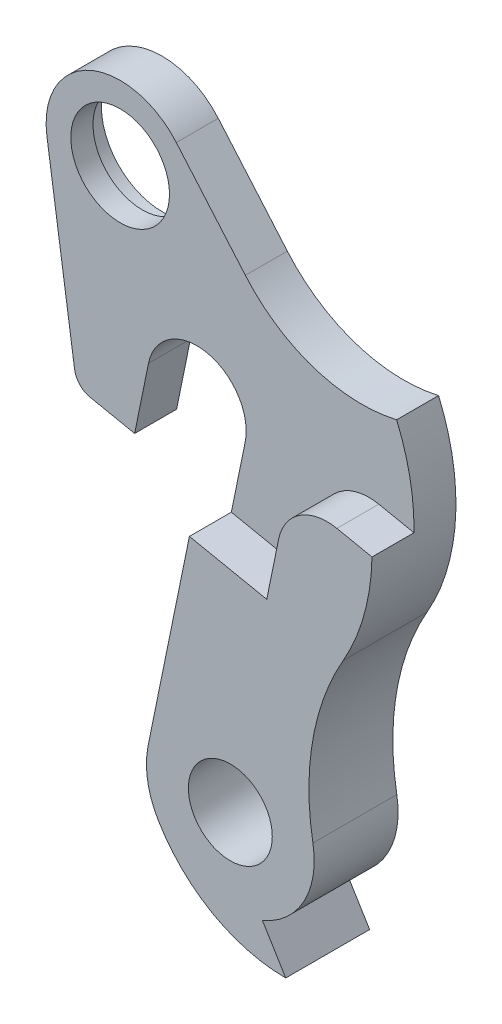
ISO-10303-21;
HEADER;
FILE_DESCRIPTION(('STEP AP214'),'2;1');
FILE_NAME('part.step','',(''),(''),'','','');
FILE_SCHEMA(('AUTOMOTIVE_DESIGN { 1 0 10303 214 1 1 1 1 }'));
ENDSEC;
DATA;
#1=APPLICATION_CONTEXT('core data for automotive mechanical design processes');
#2=APPLICATION_PROTOCOL_DEFINITION('international standard','automotive_design',2000,#1);
#3=PRODUCT_CONTEXT('',#1,'mechanical');
#4=PRODUCT('Part','Part','',(#3));
#5=PRODUCT_RELATED_PRODUCT_CATEGORY('part','',(#4));
#6=PRODUCT_DEFINITION_FORMATION('','',#4);
#7=PRODUCT_DEFINITION_CONTEXT('part definition',#1,'design');
#8=PRODUCT_DEFINITION('design','',#6,#7);
#9=PRODUCT_DEFINITION_SHAPE('','',#8);
#10=(LENGTH_UNIT() NAMED_UNIT(*) SI_UNIT(.MILLI.,.METRE.));
#11=(NAMED_UNIT(*) PLANE_ANGLE_UNIT() SI_UNIT($,.RADIAN.));
#12=(NAMED_UNIT(*) SI_UNIT($,.STERADIAN.) SOLID_ANGLE_UNIT());
#13=UNCERTAINTY_MEASURE_WITH_UNIT(LENGTH_MEASURE(1.E-05),#10,'distance_accuracy_value','');
#14=(GEOMETRIC_REPRESENTATION_CONTEXT(3) GLOBAL_UNCERTAINTY_ASSIGNED_CONTEXT((#13)) GLOBAL_UNIT_ASSIGNED_CONTEXT((#10,
#11,#12)) REPRESENTATION_CONTEXT('',''));
#15=CARTESIAN_POINT('',(0.,0.,0.));
#16=DIRECTION('',(0.,0.,1.));
#17=DIRECTION('',(1.,0.,0.));
#18=AXIS2_PLACEMENT_3D('',#15,#16,#17);
#19=CARTESIAN_POINT('',(-7.77100748891503,16.9000426806333,-4.25));
#20=DIRECTION('',(0.,0.,1.));
#21=DIRECTION('',(1.,0.,0.));
#22=AXIS2_PLACEMENT_3D('',#19,#20,#21);
#23=CYLINDRICAL_SURFACE('',#22,5.);
#24=CARTESIAN_POINT('',(-7.77100748891503,16.9000426806333,0.));
#25=DIRECTION('',(0.,0.,1.));
#26=DIRECTION('',(1.,0.,0.));
#27=AXIS2_PLACEMENT_3D('',#24,#25,#26);
#28=CIRCLE('',#27,5.);
#29=CARTESIAN_POINT('',(-2.77100748891502,16.9000426806333,0.));
#30=VERTEX_POINT('',#29);
#31=EDGE_CURVE('E175',#30,#30,#28,.T.);
#32=ORIENTED_EDGE('',*,*,#31,.T.);
#33=EDGE_LOOP('',(#32));
#34=FACE_BOUND('',#33,.T.);
#35=CARTESIAN_POINT('',(-7.77100748891503,16.9000426806333,-2.25));
#36=DIRECTION('',(0.,0.,-1.));
#37=DIRECTION('',(-1.,0.,0.));
#38=AXIS2_PLACEMENT_3D('',#35,#36,#37);
#39=CIRCLE('',#38,5.);
#40=CARTESIAN_POINT('',(-12.771007488915,16.9000426806333,-2.25));
#41=VERTEX_POINT('',#40);
#42=EDGE_CURVE('E30',#41,#41,#39,.F.);
#43=ORIENTED_EDGE('',*,*,#42,.F.);
#44=EDGE_LOOP('',(#43));
#45=FACE_BOUND('',#44,.T.);
#46=ADVANCED_FACE('F26',(#34,#45),#23,.F.);
#47=CARTESIAN_POINT('',(-6.30131824569519,-5.85605570042413,4.25));
#48=DIRECTION('',(-0.979715961235735,0.200391205645205,0.));
#49=DIRECTION('',(-0.200391205645205,-0.979715961235735,0.));
#50=AXIS2_PLACEMENT_3D('',#47,#48,#49);
#51=PLANE('',#50);
#52=DIRECTION('',(0.200391205645209,0.979715961235735,0.));
#53=VECTOR('',#52,1.);
#54=CARTESIAN_POINT('',(-6.30131824569519,-5.85605570042413,0.));
#55=LINE('',#54,#53);
#56=CARTESIAN_POINT('',(-6.30131824569519,-5.85605570042413,0.));
#57=VERTEX_POINT('',#56);
#58=CARTESIAN_POINT('',(-4.89857980617872,1.00195602822603,0.));
#59=VERTEX_POINT('',#58);
#60=EDGE_CURVE('E168',#57,#59,#55,.T.);
#61=ORIENTED_EDGE('',*,*,#60,.F.);
#62=DIRECTION('',(0.,0.,-1.));
#63=VECTOR('',#62,1.);
#64=CARTESIAN_POINT('',(-6.30131824569519,-5.85605570042413,4.25));
#65=LINE('',#64,#63);
#66=CARTESIAN_POINT('',(-6.30131824569519,-5.85605570042413,-4.25));
#67=VERTEX_POINT('',#66);
#68=EDGE_CURVE('E180',#57,#67,#65,.T.);
#69=ORIENTED_EDGE('',*,*,#68,.T.);
#70=DIRECTION('',(0.200391205645205,0.979715961235736,0.));
#71=VECTOR('',#70,1.);
#72=CARTESIAN_POINT('',(-6.30131824569519,-5.85605570042413,-4.25));
#73=LINE('',#72,#71);
#74=CARTESIAN_POINT('',(-4.89857980617872,1.00195602822603,-4.25));
#75=VERTEX_POINT('',#74);
#76=EDGE_CURVE('E279',#67,#75,#73,.T.);
#77=ORIENTED_EDGE('',*,*,#76,.T.);
#78=DIRECTION('',(0.,0.,-1.));
#79=VECTOR('',#78,1.);
#80=CARTESIAN_POINT('',(-4.89857980617872,1.00195602822603,4.25));
#81=LINE('',#80,#79);
#82=EDGE_CURVE('E11',#59,#75,#81,.T.);
#83=ORIENTED_EDGE('',*,*,#82,.F.);
#84=EDGE_LOOP('',(#61,#69,#77,#83));
#85=FACE_BOUND('',#84,.T.);
#86=ADVANCED_FACE('F28',(#85),#51,.F.);
#87=CARTESIAN_POINT('',(0.,0.,4.25));
#88=DIRECTION('',(0.,0.,-1.));
#89=DIRECTION('',(-1.,0.,0.));
#90=AXIS2_PLACEMENT_3D('',#87,#88,#89);
#91=CYLINDRICAL_SURFACE('',#90,5.00000000000004);
#92=CARTESIAN_POINT('',(0.,0.,0.));
#93=DIRECTION('',(0.,0.,-1.));
#94=DIRECTION('',(1.,0.,0.));
#95=AXIS2_PLACEMENT_3D('',#92,#93,#94);
#96=CIRCLE('',#95,5.00000000000004);
#97=CARTESIAN_POINT('',(4.89857980617871,-1.00195602822603,0.));
#98=VERTEX_POINT('',#97);
#99=EDGE_CURVE('E182',#59,#98,#96,.T.);
#100=ORIENTED_EDGE('',*,*,#99,.F.);
#101=ORIENTED_EDGE('',*,*,#82,.T.);
#102=CARTESIAN_POINT('',(0.,0.,-4.25));
#103=DIRECTION('',(0.,0.,-1.));
#104=DIRECTION('',(1.,0.,0.));
#105=AXIS2_PLACEMENT_3D('',#102,#103,#104);
#106=CIRCLE('',#105,5.00000000000004);
#107=CARTESIAN_POINT('',(4.89857980617869,-1.00195602822603,-4.25));
#108=VERTEX_POINT('',#107);
#109=EDGE_CURVE('E281',#75,#108,#106,.T.);
#110=ORIENTED_EDGE('',*,*,#109,.T.);
#111=DIRECTION('',(0.,0.,-1.));
#112=VECTOR('',#111,1.);
#113=CARTESIAN_POINT('',(4.89857980617869,-1.00195602822603,4.25));
#114=LINE('',#113,#112);
#115=EDGE_CURVE('E35',#98,#108,#114,.T.);
#116=ORIENTED_EDGE('',*,*,#115,.F.);
#117=EDGE_LOOP('',(#100,#101,#110,#116));
#118=FACE_BOUND('',#117,.T.);
#119=ADVANCED_FACE('F376',(#118),#91,.F.);
#120=CARTESIAN_POINT('',(4.89857980617869,-1.00195602822603,4.25));
#121=DIRECTION('',(0.979715961235735,-0.200391205645206,0.));
#122=DIRECTION('',(0.200391205645206,0.979715961235735,0.));
#123=AXIS2_PLACEMENT_3D('',#120,#121,#122);
#124=PLANE('',#123);
#125=DIRECTION('',(0.,0.,-1.));
#126=VECTOR('',#125,1.);
#127=CARTESIAN_POINT('',(3.49584136666226,-7.85996775687623,4.25));
#128=LINE('',#127,#126);
#129=CARTESIAN_POINT('',(3.49584136666226,-7.85996775687623,4.25));
#130=VERTEX_POINT('',#129);
#131=CARTESIAN_POINT('',(3.49584136666226,-7.85996775687623,0.));
#132=VERTEX_POINT('',#131);
#133=EDGE_CURVE('E276',#130,#132,#128,.T.);
#134=ORIENTED_EDGE('',*,*,#133,.T.);
#135=DIRECTION('',(-0.200391205645206,-0.979715961235735,0.));
#136=VECTOR('',#135,1.);
#137=CARTESIAN_POINT('',(4.89857980617871,-1.00195602822603,0.));
#138=LINE('',#137,#136);
#139=EDGE_CURVE('E237',#98,#132,#138,.T.);
#140=ORIENTED_EDGE('',*,*,#139,.F.);
#141=ORIENTED_EDGE('',*,*,#115,.T.);
#142=DIRECTION('',(-0.200391205645206,-0.979715961235735,0.));
#143=VECTOR('',#142,1.);
#144=CARTESIAN_POINT('',(4.89857980617869,-1.00195602822603,-4.25));
#145=LINE('',#144,#143);
#146=CARTESIAN_POINT('',(-0.684284829310152,-28.2966747520158,-4.25));
#147=VERTEX_POINT('',#146);
#148=EDGE_CURVE('E284',#108,#147,#145,.T.);
#149=ORIENTED_EDGE('',*,*,#148,.T.);
#150=DIRECTION('',(0.,0.,-1.));
#151=VECTOR('',#150,1.);
#152=CARTESIAN_POINT('',(-0.684284829310152,-28.2966747520158,4.25));
#153=LINE('',#152,#151);
#154=CARTESIAN_POINT('',(-0.684284829310152,-28.2966747520158,4.25));
#155=VERTEX_POINT('',#154);
#156=EDGE_CURVE('E220',#155,#147,#153,.T.);
#157=ORIENTED_EDGE('',*,*,#156,.F.);
#158=DIRECTION('',(-0.200391205645206,-0.979715961235735,0.));
#159=VECTOR('',#158,1.);
#160=CARTESIAN_POINT('',(4.89857980617869,-1.00195602822603,4.25));
#161=LINE('',#160,#159);
#162=EDGE_CURVE('E315',#130,#155,#161,.T.);
#163=ORIENTED_EDGE('',*,*,#162,.F.);
#164=EDGE_LOOP('',(#134,#140,#141,#149,#157,#163));
#165=FACE_BOUND('',#164,.T.);
#166=ADVANCED_FACE('F380',(#165),#124,.F.);
#167=CARTESIAN_POINT('',(0.,0.,4.25));
#168=DIRECTION('',(0.,0.,-1.));
#169=DIRECTION('',(-1.,0.,0.));
#170=AXIS2_PLACEMENT_3D('',#167,#168,#169);
#171=CYLINDRICAL_SURFACE('',#170,22.);
#172=DIRECTION('',(0.,0.,-1.));
#173=VECTOR('',#172,1.);
#174=CARTESIAN_POINT('',(21.9960616243364,-0.416260757692112,4.25));
#175=LINE('',#174,#173);
#176=CARTESIAN_POINT('',(21.9960616243364,-0.416260757692112,4.25));
#177=VERTEX_POINT('',#176);
#178=CARTESIAN_POINT('',(21.9960616243364,-0.416260757692112,0.));
#179=VERTEX_POINT('',#178);
#180=EDGE_CURVE('E266',#177,#179,#175,.T.);
#181=ORIENTED_EDGE('',*,*,#180,.F.);
#182=CARTESIAN_POINT('',(0.,0.,4.25));
#183=DIRECTION('',(0.,0.,1.));
#184=DIRECTION('',(1.,0.,0.));
#185=AXIS2_PLACEMENT_3D('',#182,#183,#184);
#186=CIRCLE('',#185,22.);
#187=CARTESIAN_POINT('',(19.0694947618063,-10.9706139085031,4.25));
#188=VERTEX_POINT('',#187);
#189=EDGE_CURVE('E189',#188,#177,#186,.T.);
#190=ORIENTED_EDGE('',*,*,#189,.F.);
#191=DIRECTION('',(0.,0.,-1.));
#192=VECTOR('',#191,1.);
#193=CARTESIAN_POINT('',(19.0694947618063,-10.9706139085031,4.25));
#194=LINE('',#193,#192);
#195=CARTESIAN_POINT('',(19.0694947618063,-10.9706139085031,-4.25));
#196=VERTEX_POINT('',#195);
#197=EDGE_CURVE('E205',#188,#196,#194,.T.);
#198=ORIENTED_EDGE('',*,*,#197,.T.);
#199=CARTESIAN_POINT('',(0.,0.,-4.25));
#200=DIRECTION('',(0.,0.,1.));
#201=DIRECTION('',(1.,0.,0.));
#202=AXIS2_PLACEMENT_3D('',#199,#200,#201);
#203=CIRCLE('',#202,22.);
#204=CARTESIAN_POINT('',(20.2415375209839,8.61859378243348,-4.25));
#205=VERTEX_POINT('',#204);
#206=EDGE_CURVE('E296',#196,#205,#203,.T.);
#207=ORIENTED_EDGE('',*,*,#206,.T.);
#208=DIRECTION('',(0.,0.,-1.));
#209=VECTOR('',#208,1.);
#210=CARTESIAN_POINT('',(20.2415375209839,8.61859378243348,4.25));
#211=LINE('',#210,#209);
#212=CARTESIAN_POINT('',(20.2415375209839,8.61859378243348,0.));
#213=VERTEX_POINT('',#212);
#214=EDGE_CURVE('E203',#213,#205,#211,.T.);
#215=ORIENTED_EDGE('',*,*,#214,.F.);
#216=CARTESIAN_POINT('',(0.,0.,0.));
#217=DIRECTION('',(0.,0.,1.));
#218=DIRECTION('',(1.,0.,0.));
#219=AXIS2_PLACEMENT_3D('',#216,#217,#218);
#220=CIRCLE('',#219,22.);
#221=EDGE_CURVE('E247',#179,#213,#220,.T.);
#222=ORIENTED_EDGE('',*,*,#221,.F.);
#223=EDGE_LOOP('',(#181,#190,#198,#207,#215,#222));
#224=FACE_BOUND('',#223,.T.);
#225=ADVANCED_FACE('F340',(#224),#171,.T.);
#226=CARTESIAN_POINT('',(16.7079154975436,23.7478653997338,4.25));
#227=DIRECTION('',(0.,0.,-1.));
#228=DIRECTION('',(-1.,0.,0.));
#229=AXIS2_PLACEMENT_3D('',#226,#227,#228);
#230=CYLINDRICAL_SURFACE('',#229,15.5364521134843);
#231=CARTESIAN_POINT('',(16.7079154975436,23.7478653997338,0.));
#232=DIRECTION('',(0.,0.,-1.));
#233=DIRECTION('',(1.,0.,0.));
#234=AXIS2_PLACEMENT_3D('',#231,#232,#233);
#235=CIRCLE('',#234,15.5364521134843);
#236=CARTESIAN_POINT('',(4.91725853585335,13.6304668859687,0.));
#237=VERTEX_POINT('',#236);
#238=EDGE_CURVE('E249',#213,#237,#235,.T.);
#239=ORIENTED_EDGE('',*,*,#238,.F.);
#240=ORIENTED_EDGE('',*,*,#214,.T.);
#241=CARTESIAN_POINT('',(16.7079154975436,23.7478653997338,-4.25));
#242=DIRECTION('',(0.,0.,-1.));
#243=DIRECTION('',(1.,0.,0.));
#244=AXIS2_PLACEMENT_3D('',#241,#242,#243);
#245=CIRCLE('',#244,15.5364521134843);
#246=CARTESIAN_POINT('',(4.91725853585336,13.6304668859687,-4.25));
#247=VERTEX_POINT('',#246);
#248=EDGE_CURVE('E299',#205,#247,#245,.T.);
#249=ORIENTED_EDGE('',*,*,#248,.T.);
#250=DIRECTION('',(0.,0.,-1.));
#251=VECTOR('',#250,1.);
#252=CARTESIAN_POINT('',(4.91725853585336,13.6304668859687,4.25));
#253=LINE('',#252,#251);
#254=EDGE_CURVE('E201',#237,#247,#253,.T.);
#255=ORIENTED_EDGE('',*,*,#254,.F.);
#256=EDGE_LOOP('',(#239,#240,#249,#255));
#257=FACE_BOUND('',#256,.T.);
#258=ADVANCED_FACE('F350',(#257),#230,.F.);
#259=CARTESIAN_POINT('',(4.91725853585336,13.6304668859687,4.25));
#260=DIRECTION('',(-0.758902796826889,-0.651203919650616,0.));
#261=DIRECTION('',(0.651203919650616,-0.758902796826889,0.));
#262=AXIS2_PLACEMENT_3D('',#259,#260,#261);
#263=PLANE('',#262);
#264=DIRECTION('',(-0.651203919650616,0.758902796826889,0.));
#265=VECTOR('',#264,1.);
#266=CARTESIAN_POINT('',(4.91725853585336,13.6304668859687,0.));
#267=LINE('',#266,#265);
#268=CARTESIAN_POINT('',(-2.07923651271337,21.7840720780129,0.));
#269=VERTEX_POINT('',#268);
#270=EDGE_CURVE('E251',#237,#269,#267,.T.);
#271=ORIENTED_EDGE('',*,*,#270,.F.);
#272=ORIENTED_EDGE('',*,*,#254,.T.);
#273=DIRECTION('',(-0.651203919650616,0.758902796826889,0.));
#274=VECTOR('',#273,1.);
#275=CARTESIAN_POINT('',(4.91725853585336,13.6304668859687,-4.25));
#276=LINE('',#275,#274);
#277=CARTESIAN_POINT('',(-2.07923651271337,21.7840720780129,-4.25));
#278=VERTEX_POINT('',#277);
#279=EDGE_CURVE('E302',#247,#278,#276,.T.);
#280=ORIENTED_EDGE('',*,*,#279,.T.);
#281=DIRECTION('',(0.,0.,-1.));
#282=VECTOR('',#281,1.);
#283=CARTESIAN_POINT('',(-2.07923651271337,21.7840720780129,4.25));
#284=LINE('',#283,#282);
#285=EDGE_CURVE('E199',#269,#278,#284,.T.);
#286=ORIENTED_EDGE('',*,*,#285,.F.);
#287=EDGE_LOOP('',(#271,#272,#280,#286));
#288=FACE_BOUND('',#287,.T.);
#289=ADVANCED_FACE('F354',(#288),#263,.F.);
#290=CARTESIAN_POINT('',(-7.77100748891503,16.9000426806333,4.25));
#291=DIRECTION('',(0.,0.,-1.));
#292=DIRECTION('',(-1.,0.,0.));
#293=AXIS2_PLACEMENT_3D('',#290,#291,#292);
#294=CYLINDRICAL_SURFACE('',#293,7.49999999999998);
#295=CARTESIAN_POINT('',(-7.77100748891503,16.9000426806333,0.));
#296=DIRECTION('',(0.,0.,1.));
#297=DIRECTION('',(1.,0.,0.));
#298=AXIS2_PLACEMENT_3D('',#295,#296,#297);
#299=CIRCLE('',#298,7.49999999999998);
#300=CARTESIAN_POINT('',(-15.1910762530564,15.8079897810847,0.));
#301=VERTEX_POINT('',#300);
#302=EDGE_CURVE('E253',#269,#301,#299,.T.);
#303=ORIENTED_EDGE('',*,*,#302,.F.);
#304=ORIENTED_EDGE('',*,*,#285,.T.);
#305=CARTESIAN_POINT('',(-7.77100748891503,16.9000426806333,-4.25));
#306=DIRECTION('',(0.,0.,1.));
#307=DIRECTION('',(1.,0.,0.));
#308=AXIS2_PLACEMENT_3D('',#305,#306,#307);
#309=CIRCLE('',#308,7.49999999999998);
#310=CARTESIAN_POINT('',(-15.1910762530564,15.8079897810847,-4.25));
#311=VERTEX_POINT('',#310);
#312=EDGE_CURVE('E305',#278,#311,#309,.T.);
#313=ORIENTED_EDGE('',*,*,#312,.T.);
#314=DIRECTION('',(0.,0.,-1.));
#315=VECTOR('',#314,1.);
#316=CARTESIAN_POINT('',(-15.1910762530564,15.8079897810847,4.25));
#317=LINE('',#316,#315);
#318=EDGE_CURVE('E197',#301,#311,#317,.T.);
#319=ORIENTED_EDGE('',*,*,#318,.F.);
#320=EDGE_LOOP('',(#303,#304,#313,#319));
#321=FACE_BOUND('',#320,.T.);
#322=ADVANCED_FACE('F361',(#321),#294,.T.);
#323=CARTESIAN_POINT('',(-15.1910762530564,15.8079897810847,4.25));
#324=DIRECTION('',(0.989342501885525,0.14560705327315,0.));
#325=DIRECTION('',(-0.14560705327315,0.989342501885525,0.));
#326=AXIS2_PLACEMENT_3D('',#323,#324,#325);
#327=PLANE('',#326);
#328=DIRECTION('',(0.14560705327315,-0.989342501885525,0.));
#329=VECTOR('',#328,1.);
#330=CARTESIAN_POINT('',(-15.1910762530564,15.8079897810847,0.));
#331=LINE('',#330,#329);
#332=CARTESIAN_POINT('',(-12.3837809446313,-3.26647468705211,0.));
#333=VERTEX_POINT('',#332);
#334=EDGE_CURVE('E255',#301,#333,#331,.T.);
#335=ORIENTED_EDGE('',*,*,#334,.F.);
#336=ORIENTED_EDGE('',*,*,#318,.T.);
#337=DIRECTION('',(0.14560705327315,-0.989342501885525,0.));
#338=VECTOR('',#337,1.);
#339=CARTESIAN_POINT('',(-15.1910762530564,15.8079897810847,-4.25));
#340=LINE('',#339,#338);
#341=CARTESIAN_POINT('',(-12.3837809446313,-3.26647468705211,-4.25));
#342=VERTEX_POINT('',#341);
#343=EDGE_CURVE('E308',#311,#342,#340,.T.);
#344=ORIENTED_EDGE('',*,*,#343,.T.);
#345=DIRECTION('',(0.,0.,-1.));
#346=VECTOR('',#345,1.);
#347=CARTESIAN_POINT('',(-12.3837809446313,-3.26647468705211,4.25));
#348=LINE('',#347,#346);
#349=EDGE_CURVE('E191',#333,#342,#348,.T.);
#350=ORIENTED_EDGE('',*,*,#349,.F.);
#351=EDGE_LOOP('',(#335,#336,#344,#350));
#352=FACE_BOUND('',#351,.T.);
#353=ADVANCED_FACE('F364',(#352),#327,.F.);
#354=CARTESIAN_POINT('',(-10.4050959408604,-2.97526058050582,4.25));
#355=DIRECTION('',(0.,0.,-1.));
#356=DIRECTION('',(-1.,0.,0.));
#357=AXIS2_PLACEMENT_3D('',#354,#355,#356);
#358=CYLINDRICAL_SURFACE('',#357,1.99999999999991);
#359=CARTESIAN_POINT('',(-10.4050959408604,-2.97526058050582,0.));
#360=DIRECTION('',(0.,0.,1.));
#361=DIRECTION('',(1.,0.,0.));
#362=AXIS2_PLACEMENT_3D('',#359,#360,#361);
#363=CIRCLE('',#362,1.99999999999991);
#364=CARTESIAN_POINT('',(-10.8058783521508,-4.93469250297721,0.));
#365=VERTEX_POINT('',#364);
#366=EDGE_CURVE('E171',#333,#365,#363,.T.);
#367=ORIENTED_EDGE('',*,*,#366,.F.);
#368=ORIENTED_EDGE('',*,*,#349,.T.);
#369=CARTESIAN_POINT('',(-10.4050959408604,-2.97526058050582,-4.25));
#370=DIRECTION('',(0.,0.,1.));
#371=DIRECTION('',(1.,0.,0.));
#372=AXIS2_PLACEMENT_3D('',#369,#370,#371);
#373=CIRCLE('',#372,1.99999999999991);
#374=CARTESIAN_POINT('',(-10.8058783521508,-4.93469250297721,-4.25));
#375=VERTEX_POINT('',#374);
#376=EDGE_CURVE('E311',#342,#375,#373,.T.);
#377=ORIENTED_EDGE('',*,*,#376,.T.);
#378=DIRECTION('',(0.,0.,-1.));
#379=VECTOR('',#378,1.);
#380=CARTESIAN_POINT('',(-10.8058783521508,-4.93469250297721,4.25));
#381=LINE('',#380,#379);
#382=EDGE_CURVE('E188',#365,#375,#381,.T.);
#383=ORIENTED_EDGE('',*,*,#382,.F.);
#384=EDGE_LOOP('',(#367,#368,#377,#383));
#385=FACE_BOUND('',#384,.T.);
#386=ADVANCED_FACE('F368',(#385),#358,.T.);
#387=CARTESIAN_POINT('',(-10.8058783521508,-4.93469250297721,4.25));
#388=DIRECTION('',(0.200391205645208,0.979715961235735,0.));
#389=DIRECTION('',(-0.979715961235735,0.200391205645208,0.));
#390=AXIS2_PLACEMENT_3D('',#387,#388,#389);
#391=PLANE('',#390);
#392=DIRECTION('',(0.979715961235735,-0.200391205645208,0.));
#393=VECTOR('',#392,1.);
#394=CARTESIAN_POINT('',(-10.8058783521508,-4.93469250297721,0.));
#395=LINE('',#394,#393);
#396=EDGE_CURVE('E165',#365,#57,#395,.T.);
#397=ORIENTED_EDGE('',*,*,#396,.F.);
#398=ORIENTED_EDGE('',*,*,#382,.T.);
#399=DIRECTION('',(0.979715961235735,-0.200391205645208,0.));
#400=VECTOR('',#399,1.);
#401=CARTESIAN_POINT('',(-10.8058783521508,-4.93469250297721,-4.25));
#402=LINE('',#401,#400);
#403=EDGE_CURVE('E186',#375,#67,#402,.T.);
#404=ORIENTED_EDGE('',*,*,#403,.T.);
#405=ORIENTED_EDGE('',*,*,#68,.F.);
#406=EDGE_LOOP('',(#397,#398,#404,#405));
#407=FACE_BOUND('',#406,.T.);
#408=ADVANCED_FACE('F184',(#407),#391,.F.);
#409=CARTESIAN_POINT('',(0.,0.,4.25));
#410=DIRECTION('',(0.,0.,1.));
#411=DIRECTION('',(1.,0.,0.));
#412=AXIS2_PLACEMENT_3D('',#409,#410,#411);
#413=PLANE('',#412);
#414=CARTESIAN_POINT('',(7.64330084119358,-30.,4.25));
#415=DIRECTION('',(0.,0.,1.));
#416=DIRECTION('',(1.,0.,0.));
#417=AXIS2_PLACEMENT_3D('',#414,#415,#416);
#418=CIRCLE('',#417,4.25);
#419=CARTESIAN_POINT('',(11.8933008411936,-30.,4.25));
#420=VERTEX_POINT('',#419);
#421=EDGE_CURVE('E228',#420,#420,#418,.T.);
#422=ORIENTED_EDGE('',*,*,#421,.F.);
#423=EDGE_LOOP('',(#422));
#424=FACE_BOUND('',#423,.T.);
#425=DIRECTION('',(0.200391205645206,0.979715961235735,0.));
#426=VECTOR('',#425,1.);
#427=CARTESIAN_POINT('',(11.3335690565481,-9.46309740203787,4.25));
#428=LINE('',#427,#426);
#429=CARTESIAN_POINT('',(11.3335690565481,-9.46309740203787,4.25));
#430=VERTEX_POINT('',#429);
#431=CARTESIAN_POINT('',(12.5359162904194,-3.58480163462342,4.25));
#432=VERTEX_POINT('',#431);
#433=EDGE_CURVE('E260',#430,#432,#428,.T.);
#434=ORIENTED_EDGE('',*,*,#433,.F.);
#435=DIRECTION('',(0.979715961235736,-0.200391205645204,0.));
#436=VECTOR('',#435,1.);
#437=CARTESIAN_POINT('',(3.49584136666226,-7.85996775687623,4.25));
#438=LINE('',#437,#436);
#439=EDGE_CURVE('E258',#130,#430,#438,.T.);
#440=ORIENTED_EDGE('',*,*,#439,.F.);
#441=ORIENTED_EDGE('',*,*,#162,.T.);
#442=CARTESIAN_POINT('',(7.64330084119356,-30.,4.25));
#443=DIRECTION('',(0.,0.,1.));
#444=DIRECTION('',(1.,0.,0.));
#445=AXIS2_PLACEMENT_3D('',#442,#443,#444);
#446=CIRCLE('',#445,8.49999999999996);
#447=CARTESIAN_POINT('',(0.301056865566449,-34.2826923076922,4.25));
#448=VERTEX_POINT('',#447);
#449=EDGE_CURVE('E317',#155,#448,#446,.T.);
#450=ORIENTED_EDGE('',*,*,#449,.T.);
#451=CARTESIAN_POINT('',(13.2579579990261,-26.725,4.25));
#452=DIRECTION('',(0.,0.,1.));
#453=DIRECTION('',(1.,0.,0.));
#454=AXIS2_PLACEMENT_3D('',#451,#452,#453);
#455=CIRCLE('',#454,15.);
#456=CARTESIAN_POINT('',(13.2579579990261,-41.725,4.25));
#457=VERTEX_POINT('',#456);
#458=EDGE_CURVE('E319',#448,#457,#455,.T.);
#459=ORIENTED_EDGE('',*,*,#458,.T.);
#460=DIRECTION('',(-0.521607828869279,0.853185368406115,0.));
#461=VECTOR('',#460,1.);
#462=CARTESIAN_POINT('',(10.8918223149345,-37.8547506793433,4.25));
#463=LINE('',#462,#461);
#464=CARTESIAN_POINT('',(10.8918223149345,-37.8547506793433,4.25));
#465=VERTEX_POINT('',#464);
#466=EDGE_CURVE('E321',#457,#465,#463,.T.);
#467=ORIENTED_EDGE('',*,*,#466,.T.);
#468=CARTESIAN_POINT('',(7.64330084119356,-30.,4.25));
#469=DIRECTION('',(0.,0.,1.));
#470=DIRECTION('',(1.,0.,0.));
#471=AXIS2_PLACEMENT_3D('',#468,#469,#470);
#472=CIRCLE('',#471,8.5);
#473=CARTESIAN_POINT('',(16.0109643530694,-28.5059426543732,4.25));
#474=VERTEX_POINT('',#473);
#475=EDGE_CURVE('E323',#465,#474,#472,.T.);
#476=ORIENTED_EDGE('',*,*,#475,.T.);
#477=CARTESIAN_POINT('',(41.6061703893956,-23.9358848912794,4.25));
#478=DIRECTION('',(0.,0.,-1.));
#479=DIRECTION('',(1.,0.,0.));
#480=AXIS2_PLACEMENT_3D('',#477,#478,#479);
#481=CIRCLE('',#480,26.);
#482=EDGE_CURVE('E51',#474,#188,#481,.T.);
#483=ORIENTED_EDGE('',*,*,#482,.T.);
#484=ORIENTED_EDGE('',*,*,#189,.T.);
#485=DIRECTION('',(0.979715961235734,-0.200391205645213,0.));
#486=VECTOR('',#485,1.);
#487=CARTESIAN_POINT('',(18.4364521248241,0.311822143329237,4.25));
#488=LINE('',#487,#486);
#489=CARTESIAN_POINT('',(18.4364521248241,0.311822143329239,4.25));
#490=VERTEX_POINT('',#489);
#491=EDGE_CURVE('E264',#490,#177,#488,.T.);
#492=ORIENTED_EDGE('',*,*,#491,.F.);
#493=CARTESIAN_POINT('',(17.434496096598,-4.58675766284944,4.25));
#494=DIRECTION('',(0.,0.,-1.));
#495=DIRECTION('',(1.,0.,0.));
#496=AXIS2_PLACEMENT_3D('',#493,#494,#495);
#497=CIRCLE('',#496,4.99999999999996);
#498=EDGE_CURVE('E262',#432,#490,#497,.T.);
#499=ORIENTED_EDGE('',*,*,#498,.F.);
#500=EDGE_LOOP('',(#434,#440,#441,#450,#459,#467,#476,#483,#484,#492,#499));
#501=FACE_BOUND('',#500,.T.);
#502=ADVANCED_FACE('F327',(#424,#501),#413,.T.);
#503=CARTESIAN_POINT('',(7.64330084119356,-30.,4.25));
#504=DIRECTION('',(0.,0.,-1.));
#505=DIRECTION('',(-1.,0.,0.));
#506=AXIS2_PLACEMENT_3D('',#503,#504,#505);
#507=CYLINDRICAL_SURFACE('',#506,8.49999999999996);
#508=CARTESIAN_POINT('',(7.64330084119356,-30.,-4.25));
#509=DIRECTION('',(0.,0.,1.));
#510=DIRECTION('',(1.,0.,0.));
#511=AXIS2_PLACEMENT_3D('',#508,#509,#510);
#512=CIRCLE('',#511,8.49999999999996);
#513=CARTESIAN_POINT('',(0.301056865566449,-34.2826923076922,-4.25));
#514=VERTEX_POINT('',#513);
#515=EDGE_CURVE('E286',#147,#514,#512,.T.);
#516=ORIENTED_EDGE('',*,*,#515,.T.);
#517=DIRECTION('',(0.,0.,-1.));
#518=VECTOR('',#517,1.);
#519=CARTESIAN_POINT('',(0.301056865566449,-34.2826923076922,4.25));
#520=LINE('',#519,#518);
#521=EDGE_CURVE('E217',#448,#514,#520,.T.);
#522=ORIENTED_EDGE('',*,*,#521,.F.);
#523=ORIENTED_EDGE('',*,*,#449,.F.);
#524=ORIENTED_EDGE('',*,*,#156,.T.);
#525=EDGE_LOOP('',(#516,#522,#523,#524));
#526=FACE_BOUND('',#525,.T.);
#527=ADVANCED_FACE('F430',(#526),#507,.T.);
#528=CARTESIAN_POINT('',(13.2579579990261,-26.725,4.25));
#529=DIRECTION('',(0.,0.,-1.));
#530=DIRECTION('',(-1.,0.,0.));
#531=AXIS2_PLACEMENT_3D('',#528,#529,#530);
#532=CYLINDRICAL_SURFACE('',#531,15.);
#533=CARTESIAN_POINT('',(13.2579579990261,-26.725,-4.25));
#534=DIRECTION('',(0.,0.,1.));
#535=DIRECTION('',(1.,0.,0.));
#536=AXIS2_PLACEMENT_3D('',#533,#534,#535);
#537=CIRCLE('',#536,15.);
#538=CARTESIAN_POINT('',(13.2579579990261,-41.725,-4.25));
#539=VERTEX_POINT('',#538);
#540=EDGE_CURVE('E288',#514,#539,#537,.T.);
#541=ORIENTED_EDGE('',*,*,#540,.T.);
#542=DIRECTION('',(0.,0.,-1.));
#543=VECTOR('',#542,1.);
#544=CARTESIAN_POINT('',(13.2579579990261,-41.725,4.25));
#545=LINE('',#544,#543);
#546=EDGE_CURVE('E214',#457,#539,#545,.T.);
#547=ORIENTED_EDGE('',*,*,#546,.F.);
#548=ORIENTED_EDGE('',*,*,#458,.F.);
#549=ORIENTED_EDGE('',*,*,#521,.T.);
#550=EDGE_LOOP('',(#541,#547,#548,#549));
#551=FACE_BOUND('',#550,.T.);
#552=ADVANCED_FACE('F435',(#551),#532,.T.);
#553=CARTESIAN_POINT('',(10.8918223149345,-37.8547506793433,4.25));
#554=DIRECTION('',(-0.853185368406115,-0.521607828869279,0.));
#555=DIRECTION('',(0.521607828869279,-0.853185368406114,0.));
#556=AXIS2_PLACEMENT_3D('',#553,#554,#555);
#557=PLANE('',#556);
#558=DIRECTION('',(-0.521607828869279,0.853185368406115,0.));
#559=VECTOR('',#558,1.);
#560=CARTESIAN_POINT('',(10.8918223149345,-37.8547506793433,-4.25));
#561=LINE('',#560,#559);
#562=CARTESIAN_POINT('',(10.8918223149345,-37.8547506793433,-4.25));
#563=VERTEX_POINT('',#562);
#564=EDGE_CURVE('E290',#539,#563,#561,.T.);
#565=ORIENTED_EDGE('',*,*,#564,.T.);
#566=DIRECTION('',(0.,0.,-1.));
#567=VECTOR('',#566,1.);
#568=CARTESIAN_POINT('',(10.8918223149345,-37.8547506793433,4.25));
#569=LINE('',#568,#567);
#570=EDGE_CURVE('E211',#465,#563,#569,.T.);
#571=ORIENTED_EDGE('',*,*,#570,.F.);
#572=ORIENTED_EDGE('',*,*,#466,.F.);
#573=ORIENTED_EDGE('',*,*,#546,.T.);
#574=EDGE_LOOP('',(#565,#571,#572,#573));
#575=FACE_BOUND('',#574,.T.);
#576=ADVANCED_FACE('F459',(#575),#557,.F.);
#577=CARTESIAN_POINT('',(7.64330084119356,-30.,4.25));
#578=DIRECTION('',(0.,0.,-1.));
#579=DIRECTION('',(-1.,0.,0.));
#580=AXIS2_PLACEMENT_3D('',#577,#578,#579);
#581=CYLINDRICAL_SURFACE('',#580,8.5);
#582=CARTESIAN_POINT('',(7.64330084119356,-30.,-4.25));
#583=DIRECTION('',(0.,0.,1.));
#584=DIRECTION('',(1.,0.,0.));
#585=AXIS2_PLACEMENT_3D('',#582,#583,#584);
#586=CIRCLE('',#585,8.5);
#587=CARTESIAN_POINT('',(16.0109643530694,-28.5059426543732,-4.25));
#588=VERTEX_POINT('',#587);
#589=EDGE_CURVE('E292',#563,#588,#586,.T.);
#590=ORIENTED_EDGE('',*,*,#589,.T.);
#591=DIRECTION('',(0.,0.,-1.));
#592=VECTOR('',#591,1.);
#593=CARTESIAN_POINT('',(16.0109643530694,-28.5059426543732,4.25));
#594=LINE('',#593,#592);
#595=EDGE_CURVE('E208',#474,#588,#594,.T.);
#596=ORIENTED_EDGE('',*,*,#595,.F.);
#597=ORIENTED_EDGE('',*,*,#475,.F.);
#598=ORIENTED_EDGE('',*,*,#570,.T.);
#599=EDGE_LOOP('',(#590,#596,#597,#598));
#600=FACE_BOUND('',#599,.T.);
#601=ADVANCED_FACE('F331',(#600),#581,.T.);
#602=CARTESIAN_POINT('',(41.6061703893956,-23.9358848912794,4.25));
#603=DIRECTION('',(0.,0.,-1.));
#604=DIRECTION('',(-1.,0.,0.));
#605=AXIS2_PLACEMENT_3D('',#602,#603,#604);
#606=CYLINDRICAL_SURFACE('',#605,26.);
#607=CARTESIAN_POINT('',(41.6061703893956,-23.9358848912794,-4.25));
#608=DIRECTION('',(0.,0.,-1.));
#609=DIRECTION('',(1.,0.,0.));
#610=AXIS2_PLACEMENT_3D('',#607,#608,#609);
#611=CIRCLE('',#610,26.);
#612=EDGE_CURVE('E294',#588,#196,#611,.T.);
#613=ORIENTED_EDGE('',*,*,#612,.T.);
#614=ORIENTED_EDGE('',*,*,#197,.F.);
#615=ORIENTED_EDGE('',*,*,#482,.F.);
#616=ORIENTED_EDGE('',*,*,#595,.T.);
#617=EDGE_LOOP('',(#613,#614,#615,#616));
#618=FACE_BOUND('',#617,.T.);
#619=ADVANCED_FACE('F335',(#618),#606,.F.);
#620=CARTESIAN_POINT('',(0.,0.,-4.25));
#621=DIRECTION('',(0.,0.,1.));
#622=DIRECTION('',(1.,0.,0.));
#623=AXIS2_PLACEMENT_3D('',#620,#621,#622);
#624=PLANE('',#623);
#625=CARTESIAN_POINT('',(-7.77100748891503,16.9000426806333,-4.25));
#626=DIRECTION('',(0.,0.,-1.));
#627=DIRECTION('',(-1.,0.,0.));
#628=AXIS2_PLACEMENT_3D('',#625,#626,#627);
#629=CIRCLE('',#628,6.15);
#630=CARTESIAN_POINT('',(-13.921007488915,16.9000426806333,-4.25));
#631=VERTEX_POINT('',#630);
#632=EDGE_CURVE('E543',#631,#631,#629,.T.);
#633=ORIENTED_EDGE('',*,*,#632,.F.);
#634=EDGE_LOOP('',(#633));
#635=FACE_BOUND('',#634,.T.);
#636=CARTESIAN_POINT('',(7.64330084119358,-30.,-4.25));
#637=DIRECTION('',(0.,0.,1.));
#638=DIRECTION('',(1.,0.,0.));
#639=AXIS2_PLACEMENT_3D('',#636,#637,#638);
#640=CIRCLE('',#639,4.25);
#641=CARTESIAN_POINT('',(11.8933008411936,-30.,-4.25));
#642=VERTEX_POINT('',#641);
#643=EDGE_CURVE('E224',#642,#642,#640,.T.);
#644=ORIENTED_EDGE('',*,*,#643,.T.);
#645=EDGE_LOOP('',(#644));
#646=FACE_BOUND('',#645,.T.);
#647=ORIENTED_EDGE('',*,*,#76,.F.);
#648=ORIENTED_EDGE('',*,*,#403,.F.);
#649=ORIENTED_EDGE('',*,*,#376,.F.);
#650=ORIENTED_EDGE('',*,*,#343,.F.);
#651=ORIENTED_EDGE('',*,*,#312,.F.);
#652=ORIENTED_EDGE('',*,*,#279,.F.);
#653=ORIENTED_EDGE('',*,*,#248,.F.);
#654=ORIENTED_EDGE('',*,*,#206,.F.);
#655=ORIENTED_EDGE('',*,*,#612,.F.);
#656=ORIENTED_EDGE('',*,*,#589,.F.);
#657=ORIENTED_EDGE('',*,*,#564,.F.);
#658=ORIENTED_EDGE('',*,*,#540,.F.);
#659=ORIENTED_EDGE('',*,*,#515,.F.);
#660=ORIENTED_EDGE('',*,*,#148,.F.);
#661=ORIENTED_EDGE('',*,*,#109,.F.);
#662=EDGE_LOOP('',(#647,#648,#649,#650,#651,#652,#653,#654,#655,#656,#657,#658,#659,#660,#661));
#663=FACE_BOUND('',#662,.T.);
#664=ADVANCED_FACE('F370',(#635,#646,#663),#624,.F.);
#665=CARTESIAN_POINT('',(3.49584136666226,-7.85996775687623,4.25));
#666=DIRECTION('',(0.200391205645204,0.979715961235736,0.));
#667=DIRECTION('',(-0.979715961235736,0.200391205645204,0.));
#668=AXIS2_PLACEMENT_3D('',#665,#666,#667);
#669=PLANE('',#668);
#670=DIRECTION('',(0.979715961235736,-0.200391205645204,0.));
#671=VECTOR('',#670,1.);
#672=CARTESIAN_POINT('',(3.49584136666226,-7.85996775687623,0.));
#673=LINE('',#672,#671);
#674=CARTESIAN_POINT('',(11.3335690565481,-9.46309740203787,0.));
#675=VERTEX_POINT('',#674);
#676=EDGE_CURVE('E239',#132,#675,#673,.T.);
#677=ORIENTED_EDGE('',*,*,#676,.F.);
#678=ORIENTED_EDGE('',*,*,#133,.F.);
#679=ORIENTED_EDGE('',*,*,#439,.T.);
#680=DIRECTION('',(0.,0.,-1.));
#681=VECTOR('',#680,1.);
#682=CARTESIAN_POINT('',(11.3335690565481,-9.46309740203787,4.25));
#683=LINE('',#682,#681);
#684=EDGE_CURVE('E273',#430,#675,#683,.T.);
#685=ORIENTED_EDGE('',*,*,#684,.T.);
#686=EDGE_LOOP('',(#677,#678,#679,#685));
#687=FACE_BOUND('',#686,.T.);
#688=ADVANCED_FACE('F385',(#687),#669,.T.);
#689=CARTESIAN_POINT('',(11.3335690565481,-9.46309740203787,4.25));
#690=DIRECTION('',(-0.979715961235735,0.200391205645206,0.));
#691=DIRECTION('',(-0.200391205645206,-0.979715961235735,0.));
#692=AXIS2_PLACEMENT_3D('',#689,#690,#691);
#693=PLANE('',#692);
#694=DIRECTION('',(0.200391205645206,0.979715961235735,0.));
#695=VECTOR('',#694,1.);
#696=CARTESIAN_POINT('',(11.3335690565481,-9.46309740203787,0.));
#697=LINE('',#696,#695);
#698=CARTESIAN_POINT('',(12.5359162904194,-3.58480163462342,0.));
#699=VERTEX_POINT('',#698);
#700=EDGE_CURVE('E241',#675,#699,#697,.T.);
#701=ORIENTED_EDGE('',*,*,#700,.F.);
#702=ORIENTED_EDGE('',*,*,#684,.F.);
#703=ORIENTED_EDGE('',*,*,#433,.T.);
#704=DIRECTION('',(0.,0.,-1.));
#705=VECTOR('',#704,1.);
#706=CARTESIAN_POINT('',(12.5359162904194,-3.58480163462342,4.25));
#707=LINE('',#706,#705);
#708=EDGE_CURVE('E270',#432,#699,#707,.T.);
#709=ORIENTED_EDGE('',*,*,#708,.T.);
#710=EDGE_LOOP('',(#701,#702,#703,#709));
#711=FACE_BOUND('',#710,.T.);
#712=ADVANCED_FACE('F390',(#711),#693,.T.);
#713=CARTESIAN_POINT('',(17.434496096598,-4.58675766284944,4.25));
#714=DIRECTION('',(0.,0.,-1.));
#715=DIRECTION('',(-1.,0.,0.));
#716=AXIS2_PLACEMENT_3D('',#713,#714,#715);
#717=CYLINDRICAL_SURFACE('',#716,4.99999999999996);
#718=CARTESIAN_POINT('',(17.434496096598,-4.58675766284944,0.));
#719=DIRECTION('',(0.,0.,-1.));
#720=DIRECTION('',(1.,0.,0.));
#721=AXIS2_PLACEMENT_3D('',#718,#719,#720);
#722=CIRCLE('',#721,4.99999999999996);
#723=CARTESIAN_POINT('',(18.4364521248241,0.311822143329187,0.));
#724=VERTEX_POINT('',#723);
#725=EDGE_CURVE('E243',#699,#724,#722,.T.);
#726=ORIENTED_EDGE('',*,*,#725,.F.);
#727=ORIENTED_EDGE('',*,*,#708,.F.);
#728=ORIENTED_EDGE('',*,*,#498,.T.);
#729=DIRECTION('',(0.,0.,-1.));
#730=VECTOR('',#729,1.);
#731=CARTESIAN_POINT('',(18.4364521248241,0.311822143329187,4.25));
#732=LINE('',#731,#730);
#733=EDGE_CURVE('E43',#490,#724,#732,.T.);
#734=ORIENTED_EDGE('',*,*,#733,.T.);
#735=EDGE_LOOP('',(#726,#727,#728,#734));
#736=FACE_BOUND('',#735,.T.);
#737=ADVANCED_FACE('F393',(#736),#717,.T.);
#738=CARTESIAN_POINT('',(18.4364521248241,0.311822143329237,4.25));
#739=DIRECTION('',(0.200391205645213,0.979715961235734,0.));
#740=DIRECTION('',(-0.979715961235734,0.200391205645213,0.));
#741=AXIS2_PLACEMENT_3D('',#738,#739,#740);
#742=PLANE('',#741);
#743=DIRECTION('',(0.979715961235734,-0.200391205645213,0.));
#744=VECTOR('',#743,1.);
#745=CARTESIAN_POINT('',(18.4364521248241,0.311822143329237,0.));
#746=LINE('',#745,#744);
#747=EDGE_CURVE('E245',#724,#179,#746,.T.);
#748=ORIENTED_EDGE('',*,*,#747,.F.);
#749=ORIENTED_EDGE('',*,*,#733,.F.);
#750=ORIENTED_EDGE('',*,*,#491,.T.);
#751=ORIENTED_EDGE('',*,*,#180,.T.);
#752=EDGE_LOOP('',(#748,#749,#750,#751));
#753=FACE_BOUND('',#752,.T.);
#754=ADVANCED_FACE('F344',(#753),#742,.T.);
#755=CARTESIAN_POINT('',(0.,0.,0.));
#756=DIRECTION('',(0.,0.,1.));
#757=DIRECTION('',(1.,0.,0.));
#758=AXIS2_PLACEMENT_3D('',#755,#756,#757);
#759=PLANE('',#758);
#760=ORIENTED_EDGE('',*,*,#31,.F.);
#761=EDGE_LOOP('',(#760));
#762=FACE_BOUND('',#761,.T.);
#763=ORIENTED_EDGE('',*,*,#396,.T.);
#764=ORIENTED_EDGE('',*,*,#60,.T.);
#765=ORIENTED_EDGE('',*,*,#99,.T.);
#766=ORIENTED_EDGE('',*,*,#139,.T.);
#767=ORIENTED_EDGE('',*,*,#676,.T.);
#768=ORIENTED_EDGE('',*,*,#700,.T.);
#769=ORIENTED_EDGE('',*,*,#725,.T.);
#770=ORIENTED_EDGE('',*,*,#747,.T.);
#771=ORIENTED_EDGE('',*,*,#221,.T.);
#772=ORIENTED_EDGE('',*,*,#238,.T.);
#773=ORIENTED_EDGE('',*,*,#270,.T.);
#774=ORIENTED_EDGE('',*,*,#302,.T.);
#775=ORIENTED_EDGE('',*,*,#334,.T.);
#776=ORIENTED_EDGE('',*,*,#366,.T.);
#777=EDGE_LOOP('',(#763,#764,#765,#766,#767,#768,#769,#770,#771,#772,#773,#774,#775,#776));
#778=FACE_BOUND('',#777,.T.);
#779=ADVANCED_FACE('F167',(#762,#778),#759,.T.);
#780=CARTESIAN_POINT('',(7.64330084119358,-30.,-4.25));
#781=DIRECTION('',(0.,0.,1.));
#782=DIRECTION('',(1.,0.,0.));
#783=AXIS2_PLACEMENT_3D('',#780,#781,#782);
#784=CYLINDRICAL_SURFACE('',#783,4.25);
#785=ORIENTED_EDGE('',*,*,#643,.F.);
#786=EDGE_LOOP('',(#785));
#787=FACE_BOUND('',#786,.T.);
#788=ORIENTED_EDGE('',*,*,#421,.T.);
#789=EDGE_LOOP('',(#788));
#790=FACE_BOUND('',#789,.T.);
#791=ADVANCED_FACE('F412',(#787,#790),#784,.F.);
#792=CARTESIAN_POINT('',(-7.77100748891503,16.9000426806333,-2.25));
#793=DIRECTION('',(0.,0.,-1.));
#794=DIRECTION('',(-1.,0.,0.));
#795=AXIS2_PLACEMENT_3D('',#792,#793,#794);
#796=PLANE('',#795);
#797=CARTESIAN_POINT('',(-7.77100748891503,16.9000426806333,-2.25));
#798=DIRECTION('',(0.,0.,-1.));
#799=DIRECTION('',(-1.,0.,0.));
#800=AXIS2_PLACEMENT_3D('',#797,#798,#799);
#801=CIRCLE('',#800,6.15);
#802=CARTESIAN_POINT('',(-13.921007488915,16.9000426806333,-2.25));
#803=VERTEX_POINT('',#802);
#804=EDGE_CURVE('E540',#803,#803,#801,.T.);
#805=ORIENTED_EDGE('',*,*,#804,.T.);
#806=EDGE_LOOP('',(#805));
#807=FACE_BOUND('',#806,.T.);
#808=ORIENTED_EDGE('',*,*,#42,.T.);
#809=EDGE_LOOP('',(#808));
#810=FACE_BOUND('',#809,.T.);
#811=ADVANCED_FACE('F419',(#807,#810),#796,.T.);
#812=CARTESIAN_POINT('',(-7.77100748891503,16.9000426806333,-2.25));
#813=DIRECTION('',(0.,0.,-1.));
#814=DIRECTION('',(-1.,0.,0.));
#815=AXIS2_PLACEMENT_3D('',#812,#813,#814);
#816=CYLINDRICAL_SURFACE('',#815,6.15);
#817=ORIENTED_EDGE('',*,*,#804,.F.);
#818=EDGE_LOOP('',(#817));
#819=FACE_BOUND('',#818,.T.);
#820=ORIENTED_EDGE('',*,*,#632,.T.);
#821=EDGE_LOOP('',(#820));
#822=FACE_BOUND('',#821,.T.);
#823=ADVANCED_FACE('F424',(#819,#822),#816,.F.);
#824=CLOSED_SHELL('',(#46,#86,#119,#166,#225,#258,#289,#322,#353,#386,#408,#502,#527,#552,#576,
#601,#619,#664,#688,#712,#737,#754,#779,#791,#811,#823));
#825=MANIFOLD_SOLID_BREP('B2',#824);
#826=ADVANCED_BREP_SHAPE_REPRESENTATION('',(#18,#825),#14);
#827=SHAPE_DEFINITION_REPRESENTATION(#9,#826);
ENDSEC;
END-ISO-10303-21;
